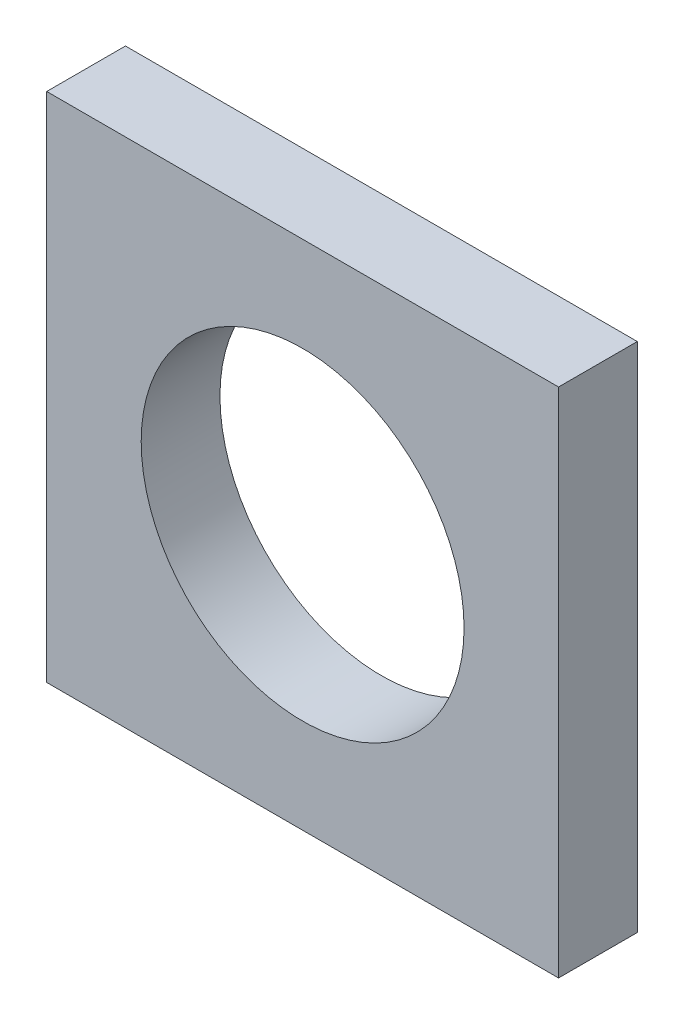
ISO-10303-21;
HEADER;
FILE_DESCRIPTION(('STEP AP214'),'2;1');
FILE_NAME('part.step','',(''),(''),'','','');
FILE_SCHEMA(('AUTOMOTIVE_DESIGN { 1 0 10303 214 1 1 1 1 }'));
ENDSEC;
DATA;
#1=APPLICATION_CONTEXT('core data for automotive mechanical design processes');
#2=APPLICATION_PROTOCOL_DEFINITION('international standard','automotive_design',2000,#1);
#3=PRODUCT_CONTEXT('',#1,'mechanical');
#4=PRODUCT('Part','Part','',(#3));
#5=PRODUCT_RELATED_PRODUCT_CATEGORY('part','',(#4));
#6=PRODUCT_DEFINITION_FORMATION('','',#4);
#7=PRODUCT_DEFINITION_CONTEXT('part definition',#1,'design');
#8=PRODUCT_DEFINITION('design','',#6,#7);
#9=PRODUCT_DEFINITION_SHAPE('','',#8);
#10=(LENGTH_UNIT() NAMED_UNIT(*) SI_UNIT(.MILLI.,.METRE.));
#11=(NAMED_UNIT(*) PLANE_ANGLE_UNIT() SI_UNIT($,.RADIAN.));
#12=(NAMED_UNIT(*) SI_UNIT($,.STERADIAN.) SOLID_ANGLE_UNIT());
#13=UNCERTAINTY_MEASURE_WITH_UNIT(LENGTH_MEASURE(1.E-05),#10,'distance_accuracy_value','');
#14=(GEOMETRIC_REPRESENTATION_CONTEXT(3) GLOBAL_UNCERTAINTY_ASSIGNED_CONTEXT((#13)) GLOBAL_UNIT_ASSIGNED_CONTEXT((#10,
#11,#12)) REPRESENTATION_CONTEXT('',''));
#15=CARTESIAN_POINT('',(0.,0.,0.));
#16=DIRECTION('',(0.,0.,1.));
#17=DIRECTION('',(1.,0.,0.));
#18=AXIS2_PLACEMENT_3D('',#15,#16,#17);
#19=CARTESIAN_POINT('',(0.,0.,0.));
#20=DIRECTION('',(0.,0.,1.));
#21=DIRECTION('',(1.,0.,0.));
#22=AXIS2_PLACEMENT_3D('',#19,#20,#21);
#23=PLANE('',#22);
#24=CARTESIAN_POINT('',(0.,0.,0.));
#25=DIRECTION('',(0.,0.,1.));
#26=DIRECTION('',(1.,0.,0.));
#27=AXIS2_PLACEMENT_3D('',#24,#25,#26);
#28=CIRCLE('',#27,4.1);
#29=CARTESIAN_POINT('',(4.1,0.,0.));
#30=VERTEX_POINT('',#29);
#31=EDGE_CURVE('E18',#30,#30,#28,.T.);
#32=ORIENTED_EDGE('',*,*,#31,.T.);
#33=EDGE_LOOP('',(#32));
#34=FACE_BOUND('',#33,.T.);
#35=DIRECTION('',(0.,1.,0.));
#36=VECTOR('',#35,1.);
#37=CARTESIAN_POINT('',(-6.5,-6.50000000000001,0.));
#38=LINE('',#37,#36);
#39=CARTESIAN_POINT('',(-6.5,6.5,0.));
#40=VERTEX_POINT('',#39);
#41=CARTESIAN_POINT('',(-6.5,-6.50000000000001,0.));
#42=VERTEX_POINT('',#41);
#43=EDGE_CURVE('E57',#40,#42,#38,.F.);
#44=ORIENTED_EDGE('',*,*,#43,.F.);
#45=DIRECTION('',(1.,0.,0.));
#46=VECTOR('',#45,1.);
#47=CARTESIAN_POINT('',(-6.5,6.5,0.));
#48=LINE('',#47,#46);
#49=CARTESIAN_POINT('',(6.5,6.5,0.));
#50=VERTEX_POINT('',#49);
#51=EDGE_CURVE('E80',#50,#40,#48,.F.);
#52=ORIENTED_EDGE('',*,*,#51,.F.);
#53=DIRECTION('',(0.,1.,0.));
#54=VECTOR('',#53,1.);
#55=CARTESIAN_POINT('',(6.5,6.50000000000001,0.));
#56=LINE('',#55,#54);
#57=CARTESIAN_POINT('',(6.5,-6.50000000000001,0.));
#58=VERTEX_POINT('',#57);
#59=EDGE_CURVE('E67',#58,#50,#56,.T.);
#60=ORIENTED_EDGE('',*,*,#59,.F.);
#61=DIRECTION('',(1.,0.,0.));
#62=VECTOR('',#61,1.);
#63=CARTESIAN_POINT('',(6.5,-6.50000000000001,0.));
#64=LINE('',#63,#62);
#65=EDGE_CURVE('E52',#42,#58,#64,.T.);
#66=ORIENTED_EDGE('',*,*,#65,.F.);
#67=EDGE_LOOP('',(#44,#52,#60,#66));
#68=FACE_BOUND('',#67,.T.);
#69=ADVANCED_FACE('F15',(#34,#68),#23,.F.);
#70=CARTESIAN_POINT('',(-6.5,-6.50000000000001,0.));
#71=DIRECTION('',(-1.,0.,0.));
#72=DIRECTION('',(0.,0.,1.));
#73=AXIS2_PLACEMENT_3D('',#70,#71,#72);
#74=PLANE('',#73);
#75=ORIENTED_EDGE('',*,*,#43,.T.);
#76=DIRECTION('',(0.,0.,-1.));
#77=VECTOR('',#76,1.);
#78=CARTESIAN_POINT('',(-6.5,-6.50000000000001,0.));
#79=LINE('',#78,#77);
#80=CARTESIAN_POINT('',(-6.5,-6.50000000000001,2.));
#81=VERTEX_POINT('',#80);
#82=EDGE_CURVE('E59',#81,#42,#79,.T.);
#83=ORIENTED_EDGE('',*,*,#82,.F.);
#84=DIRECTION('',(0.,1.,0.));
#85=VECTOR('',#84,1.);
#86=CARTESIAN_POINT('',(-6.5,0.,2.));
#87=LINE('',#86,#85);
#88=CARTESIAN_POINT('',(-6.5,6.5,2.));
#89=VERTEX_POINT('',#88);
#90=EDGE_CURVE('E83',#89,#81,#87,.F.);
#91=ORIENTED_EDGE('',*,*,#90,.F.);
#92=DIRECTION('',(0.,0.,1.));
#93=VECTOR('',#92,1.);
#94=CARTESIAN_POINT('',(-6.5,6.5,0.));
#95=LINE('',#94,#93);
#96=EDGE_CURVE('E62',#40,#89,#95,.T.);
#97=ORIENTED_EDGE('',*,*,#96,.F.);
#98=EDGE_LOOP('',(#75,#83,#91,#97));
#99=FACE_BOUND('',#98,.T.);
#100=ADVANCED_FACE('F58',(#99),#74,.T.);
#101=CARTESIAN_POINT('',(6.5,-6.50000000000001,0.));
#102=DIRECTION('',(0.,-1.,0.));
#103=DIRECTION('',(0.,0.,-1.));
#104=AXIS2_PLACEMENT_3D('',#101,#102,#103);
#105=PLANE('',#104);
#106=ORIENTED_EDGE('',*,*,#65,.T.);
#107=DIRECTION('',(0.,0.,-1.));
#108=VECTOR('',#107,1.);
#109=CARTESIAN_POINT('',(6.5,-6.50000000000001,0.));
#110=LINE('',#109,#108);
#111=CARTESIAN_POINT('',(6.5,-6.50000000000001,2.));
#112=VERTEX_POINT('',#111);
#113=EDGE_CURVE('E69',#112,#58,#110,.T.);
#114=ORIENTED_EDGE('',*,*,#113,.F.);
#115=DIRECTION('',(1.,0.,0.));
#116=VECTOR('',#115,1.);
#117=CARTESIAN_POINT('',(0.,-6.50000000000001,2.));
#118=LINE('',#117,#116);
#119=EDGE_CURVE('E73',#81,#112,#118,.T.);
#120=ORIENTED_EDGE('',*,*,#119,.F.);
#121=ORIENTED_EDGE('',*,*,#82,.T.);
#122=EDGE_LOOP('',(#106,#114,#120,#121));
#123=FACE_BOUND('',#122,.T.);
#124=ADVANCED_FACE('F71',(#123),#105,.T.);
#125=CARTESIAN_POINT('',(6.5,6.50000000000001,0.));
#126=DIRECTION('',(1.,0.,0.));
#127=DIRECTION('',(0.,0.,-1.));
#128=AXIS2_PLACEMENT_3D('',#125,#126,#127);
#129=PLANE('',#128);
#130=ORIENTED_EDGE('',*,*,#59,.T.);
#131=DIRECTION('',(0.,0.,1.));
#132=VECTOR('',#131,1.);
#133=CARTESIAN_POINT('',(6.5,6.5,0.));
#134=LINE('',#133,#132);
#135=CARTESIAN_POINT('',(6.5,6.5,2.));
#136=VERTEX_POINT('',#135);
#137=EDGE_CURVE('E32',#136,#50,#134,.F.);
#138=ORIENTED_EDGE('',*,*,#137,.F.);
#139=DIRECTION('',(0.,1.,0.));
#140=VECTOR('',#139,1.);
#141=CARTESIAN_POINT('',(6.5,0.,2.));
#142=LINE('',#141,#140);
#143=EDGE_CURVE('E86',#112,#136,#142,.T.);
#144=ORIENTED_EDGE('',*,*,#143,.F.);
#145=ORIENTED_EDGE('',*,*,#113,.T.);
#146=EDGE_LOOP('',(#130,#138,#144,#145));
#147=FACE_BOUND('',#146,.T.);
#148=ADVANCED_FACE('F96',(#147),#129,.T.);
#149=CARTESIAN_POINT('',(-6.5,6.5,0.));
#150=DIRECTION('',(0.,1.,0.));
#151=DIRECTION('',(0.,0.,1.));
#152=AXIS2_PLACEMENT_3D('',#149,#150,#151);
#153=PLANE('',#152);
#154=ORIENTED_EDGE('',*,*,#51,.T.);
#155=ORIENTED_EDGE('',*,*,#96,.T.);
#156=DIRECTION('',(1.,0.,0.));
#157=VECTOR('',#156,1.);
#158=CARTESIAN_POINT('',(0.,6.50000000000001,2.));
#159=LINE('',#158,#157);
#160=EDGE_CURVE('E24',#136,#89,#159,.F.);
#161=ORIENTED_EDGE('',*,*,#160,.F.);
#162=ORIENTED_EDGE('',*,*,#137,.T.);
#163=EDGE_LOOP('',(#154,#155,#161,#162));
#164=FACE_BOUND('',#163,.T.);
#165=ADVANCED_FACE('F93',(#164),#153,.T.);
#166=CARTESIAN_POINT('',(0.,0.,0.));
#167=DIRECTION('',(0.,0.,1.));
#168=DIRECTION('',(1.,0.,0.));
#169=AXIS2_PLACEMENT_3D('',#166,#167,#168);
#170=CYLINDRICAL_SURFACE('',#169,4.1);
#171=ORIENTED_EDGE('',*,*,#31,.F.);
#172=EDGE_LOOP('',(#171));
#173=FACE_BOUND('',#172,.T.);
#174=CARTESIAN_POINT('',(0.,0.,2.));
#175=DIRECTION('',(0.,0.,1.));
#176=DIRECTION('',(1.,0.,0.));
#177=AXIS2_PLACEMENT_3D('',#174,#175,#176);
#178=CIRCLE('',#177,4.1);
#179=CARTESIAN_POINT('',(4.1,0.,2.));
#180=VERTEX_POINT('',#179);
#181=EDGE_CURVE('E10',#180,#180,#178,.F.);
#182=ORIENTED_EDGE('',*,*,#181,.F.);
#183=EDGE_LOOP('',(#182));
#184=FACE_BOUND('',#183,.T.);
#185=ADVANCED_FACE('F95',(#173,#184),#170,.F.);
#186=CARTESIAN_POINT('',(0.,0.,2.));
#187=DIRECTION('',(0.,0.,1.));
#188=DIRECTION('',(1.,0.,0.));
#189=AXIS2_PLACEMENT_3D('',#186,#187,#188);
#190=PLANE('',#189);
#191=ORIENTED_EDGE('',*,*,#181,.T.);
#192=EDGE_LOOP('',(#191));
#193=FACE_BOUND('',#192,.T.);
#194=ORIENTED_EDGE('',*,*,#143,.T.);
#195=ORIENTED_EDGE('',*,*,#160,.T.);
#196=ORIENTED_EDGE('',*,*,#90,.T.);
#197=ORIENTED_EDGE('',*,*,#119,.T.);
#198=EDGE_LOOP('',(#194,#195,#196,#197));
#199=FACE_BOUND('',#198,.T.);
#200=ADVANCED_FACE('F91',(#193,#199),#190,.T.);
#201=CLOSED_SHELL('',(#69,#100,#124,#148,#165,#185,#200));
#202=MANIFOLD_SOLID_BREP('B1',#201);
#203=ADVANCED_BREP_SHAPE_REPRESENTATION('',(#18,#202),#14);
#204=SHAPE_DEFINITION_REPRESENTATION(#9,#203);
ENDSEC;
END-ISO-10303-21;
